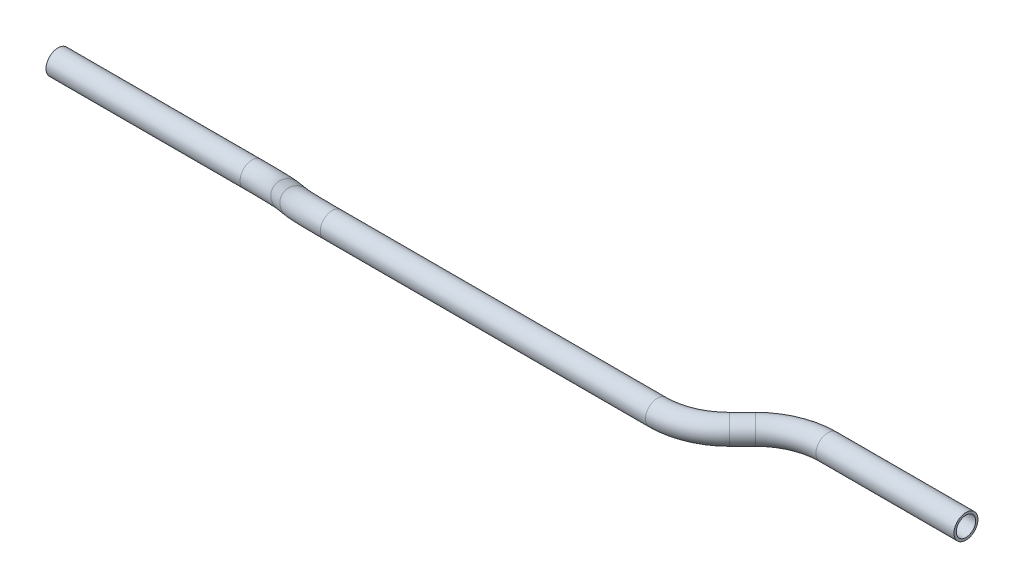
ISO-10303-21;
HEADER;
FILE_DESCRIPTION(('STEP AP214'),'2;1');
FILE_NAME('part.step','',(''),(''),'','','');
FILE_SCHEMA(('AUTOMOTIVE_DESIGN { 1 0 10303 214 1 1 1 1 }'));
ENDSEC;
DATA;
#1=APPLICATION_CONTEXT('core data for automotive mechanical design processes');
#2=APPLICATION_PROTOCOL_DEFINITION('international standard','automotive_design',2000,#1);
#3=PRODUCT_CONTEXT('',#1,'mechanical');
#4=PRODUCT('Part','Part','',(#3));
#5=PRODUCT_RELATED_PRODUCT_CATEGORY('part','',(#4));
#6=PRODUCT_DEFINITION_FORMATION('','',#4);
#7=PRODUCT_DEFINITION_CONTEXT('part definition',#1,'design');
#8=PRODUCT_DEFINITION('design','',#6,#7);
#9=PRODUCT_DEFINITION_SHAPE('','',#8);
#10=(LENGTH_UNIT() NAMED_UNIT(*) SI_UNIT(.MILLI.,.METRE.));
#11=(NAMED_UNIT(*) PLANE_ANGLE_UNIT() SI_UNIT($,.RADIAN.));
#12=(NAMED_UNIT(*) SI_UNIT($,.STERADIAN.) SOLID_ANGLE_UNIT());
#13=UNCERTAINTY_MEASURE_WITH_UNIT(LENGTH_MEASURE(1.E-05),#10,'distance_accuracy_value','');
#14=(GEOMETRIC_REPRESENTATION_CONTEXT(3) GLOBAL_UNCERTAINTY_ASSIGNED_CONTEXT((#13)) GLOBAL_UNIT_ASSIGNED_CONTEXT((#10,
#11,#12)) REPRESENTATION_CONTEXT('',''));
#15=CARTESIAN_POINT('',(0.,0.,0.));
#16=DIRECTION('',(0.,0.,1.));
#17=DIRECTION('',(1.,0.,0.));
#18=AXIS2_PLACEMENT_3D('',#15,#16,#17);
#19=CARTESIAN_POINT('',(0.,0.,0.));
#20=DIRECTION('',(1.,0.,0.));
#21=DIRECTION('',(0.,0.,-1.));
#22=AXIS2_PLACEMENT_3D('',#19,#20,#21);
#23=CYLINDRICAL_SURFACE('',#22,6.35);
#24=CARTESIAN_POINT('',(102.457120877585,0.,0.));
#25=DIRECTION('',(1.,0.,0.));
#26=DIRECTION('',(0.,0.,-1.));
#27=AXIS2_PLACEMENT_3D('',#24,#25,#26);
#28=CIRCLE('',#27,6.35);
#29=CARTESIAN_POINT('',(102.457120877585,-4.33194476985729,-4.64292521056566));
#30=VERTEX_POINT('',#29);
#31=EDGE_CURVE('E60',#30,#30,#28,.T.);
#32=ORIENTED_EDGE('',*,*,#31,.F.);
#33=EDGE_LOOP('',(#32));
#34=FACE_BOUND('',#33,.T.);
#35=CARTESIAN_POINT('',(0.,0.,0.));
#36=DIRECTION('',(1.,0.,0.));
#37=DIRECTION('',(0.,0.,-1.));
#38=AXIS2_PLACEMENT_3D('',#35,#36,#37);
#39=CIRCLE('',#38,6.35);
#40=CARTESIAN_POINT('',(0.,0.,-6.35));
#41=VERTEX_POINT('',#40);
#42=EDGE_CURVE('E57',#41,#41,#39,.T.);
#43=ORIENTED_EDGE('',*,*,#42,.T.);
#44=EDGE_LOOP('',(#43));
#45=FACE_BOUND('',#44,.T.);
#46=ADVANCED_FACE('F36',(#34,#45),#23,.T.);
#47=CARTESIAN_POINT('',(102.457120877585,25.9916686191437,27.8575512633939));
#48=DIRECTION('',(0.,-0.731169324498529,0.682196026749178));
#49=DIRECTION('',(0.,-0.682196026749178,-0.731169324498529));
#50=AXIS2_PLACEMENT_3D('',#47,#48,#49);
#51=TOROIDAL_SURFACE('',#50,38.1,6.35);
#52=CARTESIAN_POINT('',(129.397889240793,7.61278348419361,8.1592878577962));
#53=DIRECTION('',(0.707106781186547,0.482385436612863,0.517014787548497));
#54=DIRECTION('',(0.517014787548497,0.146095374217622,-0.84341677187995));
#55=AXIS2_PLACEMENT_3D('',#52,#53,#54);
#56=CIRCLE('',#55,6.35);
#57=CARTESIAN_POINT('',(133.888017301327,4.54963596170194,4.87624395686325));
#58=VERTEX_POINT('',#57);
#59=EDGE_CURVE('E63',#58,#58,#56,.T.);
#60=CARTESIAN_POINT('',(102.457120877585,25.9916686191437,27.8575512633939));
#61=DIRECTION('',(0.,-0.731169324498529,0.682196026749178));
#62=DIRECTION('',(0.,-0.682196026749178,-0.731169324498529));
#63=AXIS2_PLACEMENT_3D('',#60,#61,#62);
#64=CIRCLE('',#63,44.45);
#65=EDGE_CURVE('',#30,#58,#64,.T.);
#66=ORIENTED_EDGE('',*,*,#31,.T.);
#67=ORIENTED_EDGE('',*,*,#59,.F.);
#68=ORIENTED_EDGE('',*,*,#65,.T.);
#69=ORIENTED_EDGE('',*,*,#65,.F.);
#70=EDGE_LOOP('',(#66,#68,#67,#69));
#71=FACE_BOUND('',#70,.T.);
#72=ADVANCED_FACE('F120',(#71),#51,.T.);
#73=CARTESIAN_POINT('',(129.397889240793,7.6127834841936,8.15928785779621));
#74=DIRECTION('',(0.707106781186547,0.482385436612864,0.517014787548497));
#75=DIRECTION('',(0.590227107466681,0.,-0.807237239980611));
#76=AXIS2_PLACEMENT_3D('',#73,#74,#75);
#77=CYLINDRICAL_SURFACE('',#76,6.35);
#78=CARTESIAN_POINT('',(147.029132582749,19.6407476387243,21.0507121422038));
#79=DIRECTION('',(0.707106781186547,0.482385436612864,0.517014787548497));
#80=DIRECTION('',(0.517014787548497,0.146095374217622,-0.84341677187995));
#81=AXIS2_PLACEMENT_3D('',#78,#79,#80);
#82=CIRCLE('',#81,6.35);
#83=CARTESIAN_POINT('',(142.539004522214,22.703895161216,24.3337560431367));
#84=VERTEX_POINT('',#83);
#85=EDGE_CURVE('E66',#84,#84,#82,.T.);
#86=ORIENTED_EDGE('',*,*,#85,.F.);
#87=EDGE_LOOP('',(#86));
#88=FACE_BOUND('',#87,.T.);
#89=ORIENTED_EDGE('',*,*,#59,.T.);
#90=EDGE_LOOP('',(#89));
#91=FACE_BOUND('',#90,.T.);
#92=ADVANCED_FACE('F124',(#88,#91),#77,.T.);
#93=CARTESIAN_POINT('',(173.969900945957,1.2618625037742,1.35244873660606));
#94=DIRECTION('',(0.,0.731169324498529,-0.682196026749178));
#95=DIRECTION('',(0.,0.682196026749178,0.731169324498529));
#96=AXIS2_PLACEMENT_3D('',#93,#94,#95);
#97=TOROIDAL_SURFACE('',#96,38.1,6.35);
#98=CARTESIAN_POINT('',(173.969900945957,27.2535311229179,29.21));
#99=DIRECTION('',(1.,0.,0.));
#100=DIRECTION('',(0.,0.,-1.));
#101=AXIS2_PLACEMENT_3D('',#98,#99,#100);
#102=CIRCLE('',#101,6.35);
#103=CARTESIAN_POINT('',(173.969900945957,31.5854758927752,33.8529252105657));
#104=VERTEX_POINT('',#103);
#105=EDGE_CURVE('E69',#104,#104,#102,.T.);
#106=CARTESIAN_POINT('',(173.969900945957,1.2618625037742,1.35244873660606));
#107=DIRECTION('',(0.,0.731169324498529,-0.682196026749178));
#108=DIRECTION('',(0.,0.682196026749178,0.731169324498529));
#109=AXIS2_PLACEMENT_3D('',#106,#107,#108);
#110=CIRCLE('',#109,44.45);
#111=EDGE_CURVE('',#84,#104,#110,.T.);
#112=ORIENTED_EDGE('',*,*,#85,.T.);
#113=ORIENTED_EDGE('',*,*,#105,.F.);
#114=ORIENTED_EDGE('',*,*,#111,.T.);
#115=ORIENTED_EDGE('',*,*,#111,.F.);
#116=EDGE_LOOP('',(#112,#114,#113,#115));
#117=FACE_BOUND('',#116,.T.);
#118=ADVANCED_FACE('F128',(#117),#97,.T.);
#119=CARTESIAN_POINT('',(173.969900945957,27.2535311229179,29.21));
#120=DIRECTION('',(1.,0.,0.));
#121=DIRECTION('',(0.,1.,0.));
#122=AXIS2_PLACEMENT_3D('',#119,#120,#121);
#123=CYLINDRICAL_SURFACE('',#122,6.35);
#124=CARTESIAN_POINT('',(345.606827493126,27.2535311229179,29.21));
#125=DIRECTION('',(1.,0.,0.));
#126=DIRECTION('',(0.,0.,-1.));
#127=AXIS2_PLACEMENT_3D('',#124,#125,#126);
#128=CIRCLE('',#127,6.35);
#129=CARTESIAN_POINT('',(345.606827493126,27.2535311229179,35.56));
#130=VERTEX_POINT('',#129);
#131=EDGE_CURVE('E72',#130,#130,#128,.T.);
#132=ORIENTED_EDGE('',*,*,#131,.F.);
#133=EDGE_LOOP('',(#132));
#134=FACE_BOUND('',#133,.T.);
#135=ORIENTED_EDGE('',*,*,#105,.T.);
#136=EDGE_LOOP('',(#135));
#137=FACE_BOUND('',#136,.T.);
#138=ADVANCED_FACE('F132',(#134,#137),#123,.T.);
#139=CARTESIAN_POINT('',(345.606827493126,27.2535311229179,-8.89000000000001));
#140=DIRECTION('',(0.,1.,0.));
#141=DIRECTION('',(0.,0.,1.));
#142=AXIS2_PLACEMENT_3D('',#139,#140,#141);
#143=TOROIDAL_SURFACE('',#142,38.1,6.35);
#144=CARTESIAN_POINT('',(372.547595856334,27.2535311229179,18.0507683632074));
#145=DIRECTION('',(0.707106781186545,0.,-0.70710678118655));
#146=DIRECTION('',(-0.70710678118655,0.,-0.707106781186545));
#147=AXIS2_PLACEMENT_3D('',#144,#145,#146);
#148=CIRCLE('',#147,6.35);
#149=CARTESIAN_POINT('',(377.037723916869,27.2535311229179,22.5408964237419));
#150=VERTEX_POINT('',#149);
#151=EDGE_CURVE('E75',#150,#150,#148,.T.);
#152=CARTESIAN_POINT('',(345.606827493126,27.2535311229179,-8.89000000000001));
#153=DIRECTION('',(0.,1.,0.));
#154=DIRECTION('',(0.,0.,1.));
#155=AXIS2_PLACEMENT_3D('',#152,#153,#154);
#156=CIRCLE('',#155,44.45);
#157=EDGE_CURVE('',#130,#150,#156,.T.);
#158=ORIENTED_EDGE('',*,*,#131,.T.);
#159=ORIENTED_EDGE('',*,*,#151,.F.);
#160=ORIENTED_EDGE('',*,*,#157,.T.);
#161=ORIENTED_EDGE('',*,*,#157,.F.);
#162=EDGE_LOOP('',(#158,#160,#159,#161));
#163=FACE_BOUND('',#162,.T.);
#164=ADVANCED_FACE('F94',(#163),#143,.T.);
#165=CARTESIAN_POINT('',(372.547595856334,27.2535311229179,18.0507683632074));
#166=DIRECTION('',(0.707106781186547,0.,-0.707106781186548));
#167=DIRECTION('',(-0.707106781186548,0.,-0.707106781186547));
#168=AXIS2_PLACEMENT_3D('',#165,#166,#167);
#169=CYLINDRICAL_SURFACE('',#168,6.35);
#170=CARTESIAN_POINT('',(379.439132582749,27.2535311229179,11.1592316367926));
#171=DIRECTION('',(0.707106781186547,0.,-0.707106781186548));
#172=DIRECTION('',(-0.707106781186548,0.,-0.707106781186547));
#173=AXIS2_PLACEMENT_3D('',#170,#171,#172);
#174=CIRCLE('',#173,6.35);
#175=CARTESIAN_POINT('',(374.949004522214,27.2535311229179,6.66910357625806));
#176=VERTEX_POINT('',#175);
#177=EDGE_CURVE('E77',#176,#176,#174,.T.);
#178=ORIENTED_EDGE('',*,*,#177,.F.);
#179=EDGE_LOOP('',(#178));
#180=FACE_BOUND('',#179,.T.);
#181=ORIENTED_EDGE('',*,*,#151,.T.);
#182=EDGE_LOOP('',(#181));
#183=FACE_BOUND('',#182,.T.);
#184=ADVANCED_FACE('F87',(#180,#183),#169,.T.);
#185=CARTESIAN_POINT('',(406.379900945956,27.2535311229179,38.1));
#186=DIRECTION('',(0.,-1.,0.));
#187=DIRECTION('',(0.,0.,-1.));
#188=AXIS2_PLACEMENT_3D('',#185,#186,#187);
#189=TOROIDAL_SURFACE('',#188,38.1,6.35);
#190=CARTESIAN_POINT('',(406.379900945956,27.2535311229179,0.));
#191=DIRECTION('',(1.,0.,0.));
#192=DIRECTION('',(0.,0.,-1.));
#193=AXIS2_PLACEMENT_3D('',#190,#191,#192);
#194=CIRCLE('',#193,6.35);
#195=CARTESIAN_POINT('',(406.379900945956,27.2535311229179,-6.35000000000002));
#196=VERTEX_POINT('',#195);
#197=EDGE_CURVE('E40',#196,#196,#194,.T.);
#198=CARTESIAN_POINT('',(406.379900945956,27.2535311229179,38.1));
#199=DIRECTION('',(0.,-1.,0.));
#200=DIRECTION('',(0.,0.,-1.));
#201=AXIS2_PLACEMENT_3D('',#198,#199,#200);
#202=CIRCLE('',#201,44.45);
#203=EDGE_CURVE('',#176,#196,#202,.T.);
#204=ORIENTED_EDGE('',*,*,#177,.T.);
#205=ORIENTED_EDGE('',*,*,#197,.F.);
#206=ORIENTED_EDGE('',*,*,#203,.T.);
#207=ORIENTED_EDGE('',*,*,#203,.F.);
#208=EDGE_LOOP('',(#204,#206,#205,#207));
#209=FACE_BOUND('',#208,.T.);
#210=ADVANCED_FACE('F85',(#209),#189,.T.);
#211=CARTESIAN_POINT('',(406.379900945956,27.2535311229179,0.));
#212=DIRECTION('',(1.,0.,0.));
#213=DIRECTION('',(0.,1.,0.));
#214=AXIS2_PLACEMENT_3D('',#211,#212,#213);
#215=CYLINDRICAL_SURFACE('',#214,6.35);
#216=CARTESIAN_POINT('',(479.251838423541,27.253531122918,0.));
#217=DIRECTION('',(1.,0.,0.));
#218=DIRECTION('',(0.,0.,-1.));
#219=AXIS2_PLACEMENT_3D('',#216,#217,#218);
#220=CIRCLE('',#219,6.35);
#221=CARTESIAN_POINT('',(479.251838423541,27.253531122918,-6.34999999999996));
#222=VERTEX_POINT('',#221);
#223=EDGE_CURVE('E53',#222,#222,#220,.T.);
#224=ORIENTED_EDGE('',*,*,#223,.F.);
#225=EDGE_LOOP('',(#224));
#226=FACE_BOUND('',#225,.T.);
#227=ORIENTED_EDGE('',*,*,#197,.T.);
#228=EDGE_LOOP('',(#227));
#229=FACE_BOUND('',#228,.T.);
#230=ADVANCED_FACE('F38',(#226,#229),#215,.T.);
#231=CARTESIAN_POINT('',(0.,0.,0.));
#232=DIRECTION('',(1.,0.,0.));
#233=DIRECTION('',(0.,0.,-1.));
#234=AXIS2_PLACEMENT_3D('',#231,#232,#233);
#235=PLANE('',#234);
#236=CARTESIAN_POINT('',(0.,0.,0.));
#237=DIRECTION('',(1.,0.,0.));
#238=DIRECTION('',(0.,0.,-1.));
#239=AXIS2_PLACEMENT_3D('',#236,#237,#238);
#240=CIRCLE('',#239,5.1054);
#241=CARTESIAN_POINT('',(0.,0.,-5.1054));
#242=VERTEX_POINT('',#241);
#243=EDGE_CURVE('E56',#242,#242,#240,.F.);
#244=ORIENTED_EDGE('',*,*,#243,.F.);
#245=EDGE_LOOP('',(#244));
#246=FACE_BOUND('',#245,.T.);
#247=ORIENTED_EDGE('',*,*,#42,.F.);
#248=EDGE_LOOP('',(#247));
#249=FACE_BOUND('',#248,.T.);
#250=ADVANCED_FACE('F92',(#246,#249),#235,.F.);
#251=CARTESIAN_POINT('',(479.251838423541,27.253531122918,0.));
#252=DIRECTION('',(1.,0.,0.));
#253=DIRECTION('',(0.,0.,-1.));
#254=AXIS2_PLACEMENT_3D('',#251,#252,#253);
#255=PLANE('',#254);
#256=CARTESIAN_POINT('',(479.251838423541,27.253531122918,0.));
#257=DIRECTION('',(1.,0.,0.));
#258=DIRECTION('',(0.,0.,-1.));
#259=AXIS2_PLACEMENT_3D('',#256,#257,#258);
#260=CIRCLE('',#259,5.1054);
#261=CARTESIAN_POINT('',(479.251838423541,27.253531122918,-5.10539999999996));
#262=VERTEX_POINT('',#261);
#263=EDGE_CURVE('E10',#262,#262,#260,.F.);
#264=ORIENTED_EDGE('',*,*,#263,.T.);
#265=EDGE_LOOP('',(#264));
#266=FACE_BOUND('',#265,.T.);
#267=ORIENTED_EDGE('',*,*,#223,.T.);
#268=EDGE_LOOP('',(#267));
#269=FACE_BOUND('',#268,.T.);
#270=ADVANCED_FACE('F111',(#266,#269),#255,.T.);
#271=CARTESIAN_POINT('',(0.,0.,0.));
#272=DIRECTION('',(1.,0.,0.));
#273=DIRECTION('',(0.,0.,-1.));
#274=AXIS2_PLACEMENT_3D('',#271,#272,#273);
#275=CYLINDRICAL_SURFACE('',#274,5.1054);
#276=CARTESIAN_POINT('',(102.457120877585,0.,0.));
#277=DIRECTION('',(1.,0.,0.));
#278=DIRECTION('',(0.,0.,-1.));
#279=AXIS2_PLACEMENT_3D('',#276,#277,#278);
#280=CIRCLE('',#279,5.1054);
#281=CARTESIAN_POINT('',(102.457120877585,-3.48288359496526,-3.73291186929479));
#282=VERTEX_POINT('',#281);
#283=EDGE_CURVE('E285',#282,#282,#280,.F.);
#284=ORIENTED_EDGE('',*,*,#283,.F.);
#285=EDGE_LOOP('',(#284));
#286=FACE_BOUND('',#285,.T.);
#287=ORIENTED_EDGE('',*,*,#243,.T.);
#288=EDGE_LOOP('',(#287));
#289=FACE_BOUND('',#288,.T.);
#290=ADVANCED_FACE('F114',(#286,#289),#275,.F.);
#291=CARTESIAN_POINT('',(102.457120877585,25.9916686191437,27.8575512633939));
#292=DIRECTION('',(0.,-0.731169324498529,0.682196026749178));
#293=DIRECTION('',(0.,-0.682196026749178,-0.731169324498529));
#294=AXIS2_PLACEMENT_3D('',#291,#292,#293);
#295=TOROIDAL_SURFACE('',#294,38.1,5.1054);
#296=CARTESIAN_POINT('',(129.397889240793,7.61278348419361,8.1592878577962));
#297=DIRECTION('',(0.707106781186547,0.482385436612863,0.517014787548497));
#298=DIRECTION('',(0.517014787548497,0.146095374217622,-0.84341677187995));
#299=AXIS2_PLACEMENT_3D('',#296,#297,#298);
#300=CIRCLE('',#299,5.1054);
#301=CARTESIAN_POINT('',(133.007952201462,5.15001287611031,5.51972056144612));
#302=VERTEX_POINT('',#301);
#303=EDGE_CURVE('E282',#302,#302,#300,.F.);
#304=CARTESIAN_POINT('',(102.457120877585,25.9916686191437,27.8575512633939));
#305=DIRECTION('',(0.,-0.731169324498529,0.682196026749178));
#306=DIRECTION('',(0.,-0.682196026749178,-0.731169324498529));
#307=AXIS2_PLACEMENT_3D('',#304,#305,#306);
#308=CIRCLE('',#307,43.2054);
#309=EDGE_CURVE('',#282,#302,#308,.T.);
#310=ORIENTED_EDGE('',*,*,#283,.T.);
#311=ORIENTED_EDGE('',*,*,#303,.F.);
#312=ORIENTED_EDGE('',*,*,#309,.T.);
#313=ORIENTED_EDGE('',*,*,#309,.F.);
#314=EDGE_LOOP('',(#310,#312,#311,#313));
#315=FACE_BOUND('',#314,.T.);
#316=ADVANCED_FACE('F193',(#315),#295,.F.);
#317=CARTESIAN_POINT('',(129.397889240793,7.6127834841936,8.15928785779621));
#318=DIRECTION('',(0.707106781186547,0.482385436612864,0.517014787548497));
#319=DIRECTION('',(0.590227107466681,0.,-0.807237239980611));
#320=AXIS2_PLACEMENT_3D('',#317,#318,#319);
#321=CYLINDRICAL_SURFACE('',#320,5.1054);
#322=CARTESIAN_POINT('',(147.029132582749,19.6407476387243,21.0507121422038));
#323=DIRECTION('',(0.707106781186547,0.482385436612864,0.517014787548497));
#324=DIRECTION('',(0.517014787548497,0.146095374217622,-0.84341677187995));
#325=AXIS2_PLACEMENT_3D('',#322,#323,#324);
#326=CIRCLE('',#325,5.1054);
#327=CARTESIAN_POINT('',(143.419069622079,22.1035182468076,23.6902794385539));
#328=VERTEX_POINT('',#327);
#329=EDGE_CURVE('E279',#328,#328,#326,.F.);
#330=ORIENTED_EDGE('',*,*,#329,.F.);
#331=EDGE_LOOP('',(#330));
#332=FACE_BOUND('',#331,.T.);
#333=ORIENTED_EDGE('',*,*,#303,.T.);
#334=EDGE_LOOP('',(#333));
#335=FACE_BOUND('',#334,.T.);
#336=ADVANCED_FACE('F203',(#332,#335),#321,.F.);
#337=CARTESIAN_POINT('',(173.969900945957,1.2618625037742,1.35244873660606));
#338=DIRECTION('',(0.,0.731169324498529,-0.682196026749178));
#339=DIRECTION('',(0.,0.682196026749178,0.731169324498529));
#340=AXIS2_PLACEMENT_3D('',#337,#338,#339);
#341=TOROIDAL_SURFACE('',#340,38.1,5.1054);
#342=CARTESIAN_POINT('',(173.969900945957,27.2535311229179,29.21));
#343=DIRECTION('',(1.,0.,0.));
#344=DIRECTION('',(0.,0.,-1.));
#345=AXIS2_PLACEMENT_3D('',#342,#343,#344);
#346=CIRCLE('',#345,5.1054);
#347=CARTESIAN_POINT('',(173.969900945957,30.7364147178831,32.9429118692948));
#348=VERTEX_POINT('',#347);
#349=EDGE_CURVE('E274',#348,#348,#346,.F.);
#350=CARTESIAN_POINT('',(173.969900945957,1.2618625037742,1.35244873660606));
#351=DIRECTION('',(0.,0.731169324498529,-0.682196026749178));
#352=DIRECTION('',(0.,0.682196026749178,0.731169324498529));
#353=AXIS2_PLACEMENT_3D('',#350,#351,#352);
#354=CIRCLE('',#353,43.2054);
#355=EDGE_CURVE('',#328,#348,#354,.T.);
#356=ORIENTED_EDGE('',*,*,#329,.T.);
#357=ORIENTED_EDGE('',*,*,#349,.F.);
#358=ORIENTED_EDGE('',*,*,#355,.T.);
#359=ORIENTED_EDGE('',*,*,#355,.F.);
#360=EDGE_LOOP('',(#356,#358,#357,#359));
#361=FACE_BOUND('',#360,.T.);
#362=ADVANCED_FACE('F213',(#361),#341,.F.);
#363=CARTESIAN_POINT('',(173.969900945957,27.2535311229179,29.21));
#364=DIRECTION('',(1.,0.,0.));
#365=DIRECTION('',(0.,1.,0.));
#366=AXIS2_PLACEMENT_3D('',#363,#364,#365);
#367=CYLINDRICAL_SURFACE('',#366,5.1054);
#368=CARTESIAN_POINT('',(345.606827493126,27.2535311229179,29.21));
#369=DIRECTION('',(1.,0.,0.));
#370=DIRECTION('',(0.,0.,-1.));
#371=AXIS2_PLACEMENT_3D('',#368,#369,#370);
#372=CIRCLE('',#371,5.1054);
#373=CARTESIAN_POINT('',(345.606827493126,27.2535311229179,34.3154));
#374=VERTEX_POINT('',#373);
#375=EDGE_CURVE('E271',#374,#374,#372,.F.);
#376=ORIENTED_EDGE('',*,*,#375,.F.);
#377=EDGE_LOOP('',(#376));
#378=FACE_BOUND('',#377,.T.);
#379=ORIENTED_EDGE('',*,*,#349,.T.);
#380=EDGE_LOOP('',(#379));
#381=FACE_BOUND('',#380,.T.);
#382=ADVANCED_FACE('F223',(#378,#381),#367,.F.);
#383=CARTESIAN_POINT('',(345.606827493126,27.2535311229179,-8.89000000000001));
#384=DIRECTION('',(0.,1.,0.));
#385=DIRECTION('',(0.,0.,1.));
#386=AXIS2_PLACEMENT_3D('',#383,#384,#385);
#387=TOROIDAL_SURFACE('',#386,38.1,5.1054);
#388=CARTESIAN_POINT('',(372.547595856334,27.2535311229179,18.0507683632074));
#389=DIRECTION('',(0.707106781186545,0.,-0.70710678118655));
#390=DIRECTION('',(-0.70710678118655,0.,-0.707106781186545));
#391=AXIS2_PLACEMENT_3D('',#388,#389,#390);
#392=CIRCLE('',#391,5.1054);
#393=CARTESIAN_POINT('',(376.157658817004,27.2535311229179,21.6608313238771));
#394=VERTEX_POINT('',#393);
#395=EDGE_CURVE('E270',#394,#394,#392,.F.);
#396=CARTESIAN_POINT('',(345.606827493126,27.2535311229179,-8.89000000000001));
#397=DIRECTION('',(0.,1.,0.));
#398=DIRECTION('',(0.,0.,1.));
#399=AXIS2_PLACEMENT_3D('',#396,#397,#398);
#400=CIRCLE('',#399,43.2054);
#401=EDGE_CURVE('',#374,#394,#400,.T.);
#402=ORIENTED_EDGE('',*,*,#375,.T.);
#403=ORIENTED_EDGE('',*,*,#395,.F.);
#404=ORIENTED_EDGE('',*,*,#401,.T.);
#405=ORIENTED_EDGE('',*,*,#401,.F.);
#406=EDGE_LOOP('',(#402,#404,#403,#405));
#407=FACE_BOUND('',#406,.T.);
#408=ADVANCED_FACE('F233',(#407),#387,.F.);
#409=CARTESIAN_POINT('',(372.547595856334,27.2535311229179,18.0507683632074));
#410=DIRECTION('',(0.707106781186547,0.,-0.707106781186548));
#411=DIRECTION('',(-0.707106781186548,0.,-0.707106781186547));
#412=AXIS2_PLACEMENT_3D('',#409,#410,#411);
#413=CYLINDRICAL_SURFACE('',#412,5.1054);
#414=CARTESIAN_POINT('',(379.439132582749,27.2535311229179,11.1592316367926));
#415=DIRECTION('',(0.707106781186547,0.,-0.707106781186548));
#416=DIRECTION('',(-0.707106781186548,0.,-0.707106781186547));
#417=AXIS2_PLACEMENT_3D('',#414,#415,#416);
#418=CIRCLE('',#417,5.1054);
#419=CARTESIAN_POINT('',(375.829069622079,27.2535311229179,7.54916867612284));
#420=VERTEX_POINT('',#419);
#421=EDGE_CURVE('E49',#420,#420,#418,.F.);
#422=ORIENTED_EDGE('',*,*,#421,.F.);
#423=EDGE_LOOP('',(#422));
#424=FACE_BOUND('',#423,.T.);
#425=ORIENTED_EDGE('',*,*,#395,.T.);
#426=EDGE_LOOP('',(#425));
#427=FACE_BOUND('',#426,.T.);
#428=ADVANCED_FACE('F105',(#424,#427),#413,.F.);
#429=CARTESIAN_POINT('',(406.379900945956,27.2535311229179,38.1));
#430=DIRECTION('',(0.,-1.,0.));
#431=DIRECTION('',(0.,0.,-1.));
#432=AXIS2_PLACEMENT_3D('',#429,#430,#431);
#433=TOROIDAL_SURFACE('',#432,38.1,5.1054);
#434=CARTESIAN_POINT('',(406.379900945956,27.2535311229179,0.));
#435=DIRECTION('',(1.,0.,0.));
#436=DIRECTION('',(0.,0.,-1.));
#437=AXIS2_PLACEMENT_3D('',#434,#435,#436);
#438=CIRCLE('',#437,5.1054);
#439=CARTESIAN_POINT('',(406.379900945956,27.2535311229179,-5.10540000000001));
#440=VERTEX_POINT('',#439);
#441=EDGE_CURVE('E44',#440,#440,#438,.F.);
#442=CARTESIAN_POINT('',(406.379900945956,27.2535311229179,38.1));
#443=DIRECTION('',(0.,-1.,0.));
#444=DIRECTION('',(0.,0.,-1.));
#445=AXIS2_PLACEMENT_3D('',#442,#443,#444);
#446=CIRCLE('',#445,43.2054);
#447=EDGE_CURVE('',#420,#440,#446,.T.);
#448=ORIENTED_EDGE('',*,*,#421,.T.);
#449=ORIENTED_EDGE('',*,*,#441,.F.);
#450=ORIENTED_EDGE('',*,*,#447,.T.);
#451=ORIENTED_EDGE('',*,*,#447,.F.);
#452=EDGE_LOOP('',(#448,#450,#449,#451));
#453=FACE_BOUND('',#452,.T.);
#454=ADVANCED_FACE('F99',(#453),#433,.F.);
#455=CARTESIAN_POINT('',(406.379900945956,27.2535311229179,0.));
#456=DIRECTION('',(1.,0.,0.));
#457=DIRECTION('',(0.,1.,0.));
#458=AXIS2_PLACEMENT_3D('',#455,#456,#457);
#459=CYLINDRICAL_SURFACE('',#458,5.1054);
#460=ORIENTED_EDGE('',*,*,#263,.F.);
#461=EDGE_LOOP('',(#460));
#462=FACE_BOUND('',#461,.T.);
#463=ORIENTED_EDGE('',*,*,#441,.T.);
#464=EDGE_LOOP('',(#463));
#465=FACE_BOUND('',#464,.T.);
#466=ADVANCED_FACE('F97',(#462,#465),#459,.F.);
#467=CLOSED_SHELL('',(#46,#72,#92,#118,#138,#164,#184,#210,#230,#250,#270,#290,#316,#336,#362,
#382,#408,#428,#454,#466));
#468=MANIFOLD_SOLID_BREP('B2',#467);
#469=ADVANCED_BREP_SHAPE_REPRESENTATION('',(#18,#468),#14);
#470=SHAPE_DEFINITION_REPRESENTATION(#9,#469);
ENDSEC;
END-ISO-10303-21;
